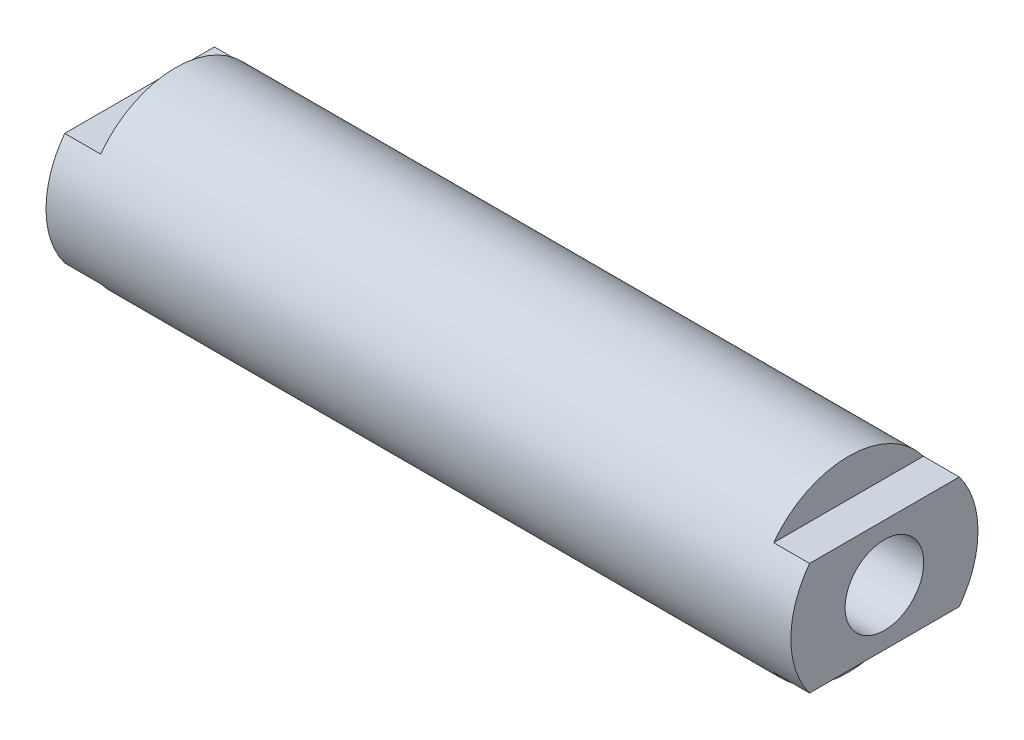
ISO-10303-21;
HEADER;
FILE_DESCRIPTION(('STEP AP214'),'2;1');
FILE_NAME('part.step','',(''),(''),'','','');
FILE_SCHEMA(('AUTOMOTIVE_DESIGN { 1 0 10303 214 1 1 1 1 }'));
ENDSEC;
DATA;
#1=APPLICATION_CONTEXT('core data for automotive mechanical design processes');
#2=APPLICATION_PROTOCOL_DEFINITION('international standard','automotive_design',2000,#1);
#3=PRODUCT_CONTEXT('',#1,'mechanical');
#4=PRODUCT('Part','Part','',(#3));
#5=PRODUCT_RELATED_PRODUCT_CATEGORY('part','',(#4));
#6=PRODUCT_DEFINITION_FORMATION('','',#4);
#7=PRODUCT_DEFINITION_CONTEXT('part definition',#1,'design');
#8=PRODUCT_DEFINITION('design','',#6,#7);
#9=PRODUCT_DEFINITION_SHAPE('','',#8);
#10=(LENGTH_UNIT() NAMED_UNIT(*) SI_UNIT(.MILLI.,.METRE.));
#11=(NAMED_UNIT(*) PLANE_ANGLE_UNIT() SI_UNIT($,.RADIAN.));
#12=(NAMED_UNIT(*) SI_UNIT($,.STERADIAN.) SOLID_ANGLE_UNIT());
#13=UNCERTAINTY_MEASURE_WITH_UNIT(LENGTH_MEASURE(1.E-05),#10,'distance_accuracy_value','');
#14=(GEOMETRIC_REPRESENTATION_CONTEXT(3) GLOBAL_UNCERTAINTY_ASSIGNED_CONTEXT((#13)) GLOBAL_UNIT_ASSIGNED_CONTEXT((#10,
#11,#12)) REPRESENTATION_CONTEXT('',''));
#15=CARTESIAN_POINT('',(0.,0.,0.));
#16=DIRECTION('',(0.,0.,1.));
#17=DIRECTION('',(1.,0.,0.));
#18=AXIS2_PLACEMENT_3D('',#15,#16,#17);
#19=CARTESIAN_POINT('',(-69.457729468599,0.,0.));
#20=DIRECTION('',(-1.,0.,0.));
#21=DIRECTION('',(0.,0.,1.));
#22=AXIS2_PLACEMENT_3D('',#19,#20,#21);
#23=CYLINDRICAL_SURFACE('',#22,12.5);
#24=DIRECTION('',(-1.,0.,0.));
#25=VECTOR('',#24,1.);
#26=CARTESIAN_POINT('',(-69.457729468599,-7.5,-10.));
#27=LINE('',#26,#25);
#28=CARTESIAN_POINT('',(-49.75,-7.5,-10.));
#29=VERTEX_POINT('',#28);
#30=CARTESIAN_POINT('',(-44.95,-7.5,-10.));
#31=VERTEX_POINT('',#30);
#32=EDGE_CURVE('E143',#29,#31,#27,.F.);
#33=ORIENTED_EDGE('',*,*,#32,.F.);
#34=CARTESIAN_POINT('',(-49.75,0.,0.));
#35=DIRECTION('',(-1.,0.,0.));
#36=DIRECTION('',(0.,0.,1.));
#37=AXIS2_PLACEMENT_3D('',#34,#35,#36);
#38=CIRCLE('',#37,12.5);
#39=CARTESIAN_POINT('',(-49.75,7.5,-10.));
#40=VERTEX_POINT('',#39);
#41=EDGE_CURVE('E128',#40,#29,#38,.T.);
#42=ORIENTED_EDGE('',*,*,#41,.F.);
#43=DIRECTION('',(-1.,0.,0.));
#44=VECTOR('',#43,1.);
#45=CARTESIAN_POINT('',(-69.457729468599,7.5,-10.));
#46=LINE('',#45,#44);
#47=CARTESIAN_POINT('',(-44.95,7.5,-10.));
#48=VERTEX_POINT('',#47);
#49=EDGE_CURVE('E131',#40,#48,#46,.F.);
#50=ORIENTED_EDGE('',*,*,#49,.T.);
#51=CARTESIAN_POINT('',(-44.95,0.,0.));
#52=DIRECTION('',(1.,0.,0.));
#53=DIRECTION('',(0.,0.,-1.));
#54=AXIS2_PLACEMENT_3D('',#51,#52,#53);
#55=CIRCLE('',#54,12.5);
#56=CARTESIAN_POINT('',(-44.95,7.5,10.));
#57=VERTEX_POINT('',#56);
#58=EDGE_CURVE('E134',#48,#57,#55,.T.);
#59=ORIENTED_EDGE('',*,*,#58,.T.);
#60=DIRECTION('',(-1.,0.,0.));
#61=VECTOR('',#60,1.);
#62=CARTESIAN_POINT('',(-69.457729468599,7.5,10.));
#63=LINE('',#62,#61);
#64=CARTESIAN_POINT('',(-49.75,7.5,10.));
#65=VERTEX_POINT('',#64);
#66=EDGE_CURVE('E136',#57,#65,#63,.T.);
#67=ORIENTED_EDGE('',*,*,#66,.T.);
#68=CARTESIAN_POINT('',(-49.75,-7.5,10.));
#69=VERTEX_POINT('',#68);
#70=EDGE_CURVE('E122',#69,#65,#38,.T.);
#71=ORIENTED_EDGE('',*,*,#70,.F.);
#72=DIRECTION('',(-1.,0.,0.));
#73=VECTOR('',#72,1.);
#74=CARTESIAN_POINT('',(-69.457729468599,-7.5,10.));
#75=LINE('',#74,#73);
#76=CARTESIAN_POINT('',(-44.95,-7.5,10.));
#77=VERTEX_POINT('',#76);
#78=EDGE_CURVE('E141',#77,#69,#75,.T.);
#79=ORIENTED_EDGE('',*,*,#78,.F.);
#80=CARTESIAN_POINT('',(-44.95,0.,0.));
#81=DIRECTION('',(-1.,0.,0.));
#82=DIRECTION('',(0.,0.,1.));
#83=AXIS2_PLACEMENT_3D('',#80,#81,#82);
#84=CIRCLE('',#83,12.5);
#85=EDGE_CURVE('E139',#31,#77,#84,.T.);
#86=ORIENTED_EDGE('',*,*,#85,.F.);
#87=EDGE_LOOP('',(#33,#42,#50,#59,#67,#71,#79,#86));
#88=FACE_BOUND('',#87,.T.);
#89=DIRECTION('',(-1.,0.,0.));
#90=VECTOR('',#89,1.);
#91=CARTESIAN_POINT('',(-69.457729468599,7.5,-10.));
#92=LINE('',#91,#90);
#93=CARTESIAN_POINT('',(49.75,7.5,-10.));
#94=VERTEX_POINT('',#93);
#95=CARTESIAN_POINT('',(44.95,7.5,-10.));
#96=VERTEX_POINT('',#95);
#97=EDGE_CURVE('E108',#94,#96,#92,.T.);
#98=ORIENTED_EDGE('',*,*,#97,.F.);
#99=CARTESIAN_POINT('',(49.75,0.,0.));
#100=DIRECTION('',(-1.,0.,0.));
#101=DIRECTION('',(0.,0.,1.));
#102=AXIS2_PLACEMENT_3D('',#99,#100,#101);
#103=CIRCLE('',#102,12.5);
#104=CARTESIAN_POINT('',(49.75,-7.5,-10.));
#105=VERTEX_POINT('',#104);
#106=EDGE_CURVE('E59',#94,#105,#103,.T.);
#107=ORIENTED_EDGE('',*,*,#106,.T.);
#108=DIRECTION('',(-1.,0.,0.));
#109=VECTOR('',#108,1.);
#110=CARTESIAN_POINT('',(-69.457729468599,-7.5,-10.));
#111=LINE('',#110,#109);
#112=CARTESIAN_POINT('',(44.95,-7.5,-10.));
#113=VERTEX_POINT('',#112);
#114=EDGE_CURVE('E150',#105,#113,#111,.T.);
#115=ORIENTED_EDGE('',*,*,#114,.T.);
#116=CARTESIAN_POINT('',(44.95,0.,0.));
#117=DIRECTION('',(-1.,0.,0.));
#118=DIRECTION('',(0.,0.,1.));
#119=AXIS2_PLACEMENT_3D('',#116,#117,#118);
#120=CIRCLE('',#119,12.5);
#121=CARTESIAN_POINT('',(44.95,-7.5,10.));
#122=VERTEX_POINT('',#121);
#123=EDGE_CURVE('E113',#113,#122,#120,.T.);
#124=ORIENTED_EDGE('',*,*,#123,.T.);
#125=DIRECTION('',(-1.,0.,0.));
#126=VECTOR('',#125,1.);
#127=CARTESIAN_POINT('',(-69.457729468599,-7.5,10.));
#128=LINE('',#127,#126);
#129=CARTESIAN_POINT('',(49.75,-7.5,10.));
#130=VERTEX_POINT('',#129);
#131=EDGE_CURVE('E149',#122,#130,#128,.F.);
#132=ORIENTED_EDGE('',*,*,#131,.T.);
#133=CARTESIAN_POINT('',(49.75,7.5,10.));
#134=VERTEX_POINT('',#133);
#135=EDGE_CURVE('E119',#130,#134,#103,.T.);
#136=ORIENTED_EDGE('',*,*,#135,.T.);
#137=DIRECTION('',(-1.,0.,0.));
#138=VECTOR('',#137,1.);
#139=CARTESIAN_POINT('',(-69.457729468599,7.5,10.));
#140=LINE('',#139,#138);
#141=CARTESIAN_POINT('',(44.95,7.5,10.));
#142=VERTEX_POINT('',#141);
#143=EDGE_CURVE('E51',#142,#134,#140,.F.);
#144=ORIENTED_EDGE('',*,*,#143,.F.);
#145=CARTESIAN_POINT('',(44.95,0.,0.));
#146=DIRECTION('',(1.,0.,0.));
#147=DIRECTION('',(0.,0.,-1.));
#148=AXIS2_PLACEMENT_3D('',#145,#146,#147);
#149=CIRCLE('',#148,12.5);
#150=EDGE_CURVE('E11',#96,#142,#149,.T.);
#151=ORIENTED_EDGE('',*,*,#150,.F.);
#152=EDGE_LOOP('',(#98,#107,#115,#124,#132,#136,#144,#151));
#153=FACE_BOUND('',#152,.T.);
#154=ADVANCED_FACE('F36',(#88,#153),#23,.T.);
#155=CARTESIAN_POINT('',(49.75,0.,0.));
#156=DIRECTION('',(-1.,0.,0.));
#157=DIRECTION('',(0.,0.,1.));
#158=AXIS2_PLACEMENT_3D('',#155,#156,#157);
#159=PLANE('',#158);
#160=CARTESIAN_POINT('',(49.75,0.,0.));
#161=DIRECTION('',(1.,0.,0.));
#162=DIRECTION('',(0.,0.,-1.));
#163=AXIS2_PLACEMENT_3D('',#160,#161,#162);
#164=CIRCLE('',#163,5.25);
#165=CARTESIAN_POINT('',(49.75,0.,-5.25));
#166=VERTEX_POINT('',#165);
#167=EDGE_CURVE('E114',#166,#166,#164,.T.);
#168=ORIENTED_EDGE('',*,*,#167,.F.);
#169=EDGE_LOOP('',(#168));
#170=FACE_BOUND('',#169,.T.);
#171=DIRECTION('',(0.,0.,-1.));
#172=VECTOR('',#171,1.);
#173=CARTESIAN_POINT('',(49.75,7.5,0.));
#174=LINE('',#173,#172);
#175=EDGE_CURVE('E44',#134,#94,#174,.T.);
#176=ORIENTED_EDGE('',*,*,#175,.F.);
#177=ORIENTED_EDGE('',*,*,#135,.F.);
#178=DIRECTION('',(0.,0.,-1.));
#179=VECTOR('',#178,1.);
#180=CARTESIAN_POINT('',(49.75,-7.5,0.));
#181=LINE('',#180,#179);
#182=EDGE_CURVE('E118',#130,#105,#181,.T.);
#183=ORIENTED_EDGE('',*,*,#182,.T.);
#184=ORIENTED_EDGE('',*,*,#106,.F.);
#185=EDGE_LOOP('',(#176,#177,#183,#184));
#186=FACE_BOUND('',#185,.T.);
#187=ADVANCED_FACE('F117',(#170,#186),#159,.F.);
#188=CARTESIAN_POINT('',(-49.75,0.,0.));
#189=DIRECTION('',(1.,0.,0.));
#190=DIRECTION('',(0.,0.,-1.));
#191=AXIS2_PLACEMENT_3D('',#188,#189,#190);
#192=PLANE('',#191);
#193=CARTESIAN_POINT('',(-49.75,0.,0.));
#194=DIRECTION('',(-1.,0.,0.));
#195=DIRECTION('',(0.,0.,1.));
#196=AXIS2_PLACEMENT_3D('',#193,#194,#195);
#197=CIRCLE('',#196,5.25);
#198=CARTESIAN_POINT('',(-49.75,0.,5.25));
#199=VERTEX_POINT('',#198);
#200=EDGE_CURVE('E166',#199,#199,#197,.T.);
#201=ORIENTED_EDGE('',*,*,#200,.F.);
#202=EDGE_LOOP('',(#201));
#203=FACE_BOUND('',#202,.T.);
#204=DIRECTION('',(0.,0.,1.));
#205=VECTOR('',#204,1.);
#206=CARTESIAN_POINT('',(-49.75,-7.5,-12.5));
#207=LINE('',#206,#205);
#208=EDGE_CURVE('E173',#29,#69,#207,.T.);
#209=ORIENTED_EDGE('',*,*,#208,.T.);
#210=ORIENTED_EDGE('',*,*,#70,.T.);
#211=DIRECTION('',(0.,0.,1.));
#212=VECTOR('',#211,1.);
#213=CARTESIAN_POINT('',(-49.75,7.5,-12.5));
#214=LINE('',#213,#212);
#215=EDGE_CURVE('E124',#40,#65,#214,.T.);
#216=ORIENTED_EDGE('',*,*,#215,.F.);
#217=ORIENTED_EDGE('',*,*,#41,.T.);
#218=EDGE_LOOP('',(#209,#210,#216,#217));
#219=FACE_BOUND('',#218,.T.);
#220=ADVANCED_FACE('F38',(#203,#219),#192,.F.);
#221=CARTESIAN_POINT('',(-44.95,12.5,-12.5));
#222=DIRECTION('',(1.,0.,0.));
#223=DIRECTION('',(0.,0.,-1.));
#224=AXIS2_PLACEMENT_3D('',#221,#222,#223);
#225=PLANE('',#224);
#226=DIRECTION('',(0.,0.,1.));
#227=VECTOR('',#226,1.);
#228=CARTESIAN_POINT('',(-44.95,7.5,-12.5));
#229=LINE('',#228,#227);
#230=EDGE_CURVE('E120',#48,#57,#229,.T.);
#231=ORIENTED_EDGE('',*,*,#230,.T.);
#232=ORIENTED_EDGE('',*,*,#58,.F.);
#233=EDGE_LOOP('',(#231,#232));
#234=FACE_BOUND('',#233,.T.);
#235=ADVANCED_FACE('F194',(#234),#225,.F.);
#236=CARTESIAN_POINT('',(-49.75,7.5,-12.5));
#237=DIRECTION('',(0.,-1.,0.));
#238=DIRECTION('',(0.,0.,-1.));
#239=AXIS2_PLACEMENT_3D('',#236,#237,#238);
#240=PLANE('',#239);
#241=ORIENTED_EDGE('',*,*,#230,.F.);
#242=ORIENTED_EDGE('',*,*,#49,.F.);
#243=ORIENTED_EDGE('',*,*,#215,.T.);
#244=ORIENTED_EDGE('',*,*,#66,.F.);
#245=EDGE_LOOP('',(#241,#242,#243,#244));
#246=FACE_BOUND('',#245,.T.);
#247=ADVANCED_FACE('F191',(#246),#240,.F.);
#248=CARTESIAN_POINT('',(-49.75,-7.5,-12.5));
#249=DIRECTION('',(0.,-1.,0.));
#250=DIRECTION('',(0.,0.,-1.));
#251=AXIS2_PLACEMENT_3D('',#248,#249,#250);
#252=PLANE('',#251);
#253=ORIENTED_EDGE('',*,*,#78,.T.);
#254=ORIENTED_EDGE('',*,*,#208,.F.);
#255=ORIENTED_EDGE('',*,*,#32,.T.);
#256=DIRECTION('',(0.,0.,1.));
#257=VECTOR('',#256,1.);
#258=CARTESIAN_POINT('',(-44.95,-7.5,-12.5));
#259=LINE('',#258,#257);
#260=EDGE_CURVE('E172',#31,#77,#259,.T.);
#261=ORIENTED_EDGE('',*,*,#260,.T.);
#262=EDGE_LOOP('',(#253,#254,#255,#261));
#263=FACE_BOUND('',#262,.T.);
#264=ADVANCED_FACE('F180',(#263),#252,.T.);
#265=CARTESIAN_POINT('',(-44.95,-12.5,-12.5));
#266=DIRECTION('',(-1.,0.,0.));
#267=DIRECTION('',(0.,0.,1.));
#268=AXIS2_PLACEMENT_3D('',#265,#266,#267);
#269=PLANE('',#268);
#270=ORIENTED_EDGE('',*,*,#260,.F.);
#271=ORIENTED_EDGE('',*,*,#85,.T.);
#272=EDGE_LOOP('',(#270,#271));
#273=FACE_BOUND('',#272,.T.);
#274=ADVANCED_FACE('F246',(#273),#269,.T.);
#275=CARTESIAN_POINT('',(-16.75,0.,0.));
#276=DIRECTION('',(-1.,0.,0.));
#277=DIRECTION('',(0.,0.,1.));
#278=AXIS2_PLACEMENT_3D('',#275,#276,#277);
#279=CONICAL_SURFACE('',#278,5.24999999999999,1.02974425867665);
#280=CARTESIAN_POINT('',(-13.5954817501053,0.,0.));
#281=VERTEX_POINT('',#280);
#282=VERTEX_LOOP('',#281);
#283=FACE_BOUND('',#282,.T.);
#284=CARTESIAN_POINT('',(-16.75,0.,0.));
#285=DIRECTION('',(-1.,0.,0.));
#286=DIRECTION('',(0.,0.,1.));
#287=AXIS2_PLACEMENT_3D('',#284,#285,#286);
#288=CIRCLE('',#287,5.24999999999999);
#289=CARTESIAN_POINT('',(-16.75,0.,5.24999999999999));
#290=VERTEX_POINT('',#289);
#291=EDGE_CURVE('E169',#290,#290,#288,.T.);
#292=ORIENTED_EDGE('',*,*,#291,.T.);
#293=EDGE_LOOP('',(#292));
#294=FACE_BOUND('',#293,.T.);
#295=ADVANCED_FACE('F242',(#283,#294),#279,.F.);
#296=CARTESIAN_POINT('',(-49.75,0.,0.));
#297=DIRECTION('',(-1.,0.,0.));
#298=DIRECTION('',(0.,0.,1.));
#299=AXIS2_PLACEMENT_3D('',#296,#297,#298);
#300=CYLINDRICAL_SURFACE('',#299,5.24999999999999);
#301=ORIENTED_EDGE('',*,*,#291,.F.);
#302=EDGE_LOOP('',(#301));
#303=FACE_BOUND('',#302,.T.);
#304=ORIENTED_EDGE('',*,*,#200,.T.);
#305=EDGE_LOOP('',(#304));
#306=FACE_BOUND('',#305,.T.);
#307=ADVANCED_FACE('F237',(#303,#306),#300,.F.);
#308=CARTESIAN_POINT('',(44.95,-12.5,-12.5));
#309=DIRECTION('',(-1.,0.,0.));
#310=DIRECTION('',(0.,0.,1.));
#311=AXIS2_PLACEMENT_3D('',#308,#309,#310);
#312=PLANE('',#311);
#313=DIRECTION('',(0.,0.,1.));
#314=VECTOR('',#313,1.);
#315=CARTESIAN_POINT('',(44.95,-7.5,-12.5));
#316=LINE('',#315,#314);
#317=EDGE_CURVE('E155',#113,#122,#316,.T.);
#318=ORIENTED_EDGE('',*,*,#317,.T.);
#319=ORIENTED_EDGE('',*,*,#123,.F.);
#320=EDGE_LOOP('',(#318,#319));
#321=FACE_BOUND('',#320,.T.);
#322=ADVANCED_FACE('F154',(#321),#312,.F.);
#323=CARTESIAN_POINT('',(49.75,-7.5,-12.5));
#324=DIRECTION('',(0.,1.,0.));
#325=DIRECTION('',(0.,0.,1.));
#326=AXIS2_PLACEMENT_3D('',#323,#324,#325);
#327=PLANE('',#326);
#328=ORIENTED_EDGE('',*,*,#182,.F.);
#329=ORIENTED_EDGE('',*,*,#131,.F.);
#330=ORIENTED_EDGE('',*,*,#317,.F.);
#331=ORIENTED_EDGE('',*,*,#114,.F.);
#332=EDGE_LOOP('',(#328,#329,#330,#331));
#333=FACE_BOUND('',#332,.T.);
#334=ADVANCED_FACE('F157',(#333),#327,.F.);
#335=CARTESIAN_POINT('',(16.75,0.,0.));
#336=DIRECTION('',(1.,0.,0.));
#337=DIRECTION('',(0.,0.,-1.));
#338=AXIS2_PLACEMENT_3D('',#335,#336,#337);
#339=CONICAL_SURFACE('',#338,5.24999999999999,1.02974425867665);
#340=CARTESIAN_POINT('',(13.5954817501053,0.,0.));
#341=VERTEX_POINT('',#340);
#342=VERTEX_LOOP('',#341);
#343=FACE_BOUND('',#342,.T.);
#344=CARTESIAN_POINT('',(16.75,0.,0.));
#345=DIRECTION('',(1.,0.,0.));
#346=DIRECTION('',(0.,0.,-1.));
#347=AXIS2_PLACEMENT_3D('',#344,#345,#346);
#348=CIRCLE('',#347,5.24999999999999);
#349=CARTESIAN_POINT('',(16.75,0.,-5.24999999999999));
#350=VERTEX_POINT('',#349);
#351=EDGE_CURVE('E158',#350,#350,#348,.T.);
#352=ORIENTED_EDGE('',*,*,#351,.T.);
#353=EDGE_LOOP('',(#352));
#354=FACE_BOUND('',#353,.T.);
#355=ADVANCED_FACE('F228',(#343,#354),#339,.F.);
#356=CARTESIAN_POINT('',(49.75,0.,0.));
#357=DIRECTION('',(1.,0.,0.));
#358=DIRECTION('',(0.,0.,-1.));
#359=AXIS2_PLACEMENT_3D('',#356,#357,#358);
#360=CYLINDRICAL_SURFACE('',#359,5.24999999999999);
#361=ORIENTED_EDGE('',*,*,#351,.F.);
#362=EDGE_LOOP('',(#361));
#363=FACE_BOUND('',#362,.T.);
#364=ORIENTED_EDGE('',*,*,#167,.T.);
#365=EDGE_LOOP('',(#364));
#366=FACE_BOUND('',#365,.T.);
#367=ADVANCED_FACE('F221',(#363,#366),#360,.F.);
#368=CARTESIAN_POINT('',(44.95,12.5,-12.5));
#369=DIRECTION('',(1.,0.,0.));
#370=DIRECTION('',(0.,0.,-1.));
#371=AXIS2_PLACEMENT_3D('',#368,#369,#370);
#372=PLANE('',#371);
#373=DIRECTION('',(0.,0.,1.));
#374=VECTOR('',#373,1.);
#375=CARTESIAN_POINT('',(44.95,7.5,-12.5));
#376=LINE('',#375,#374);
#377=EDGE_CURVE('E217',#96,#142,#376,.T.);
#378=ORIENTED_EDGE('',*,*,#377,.F.);
#379=ORIENTED_EDGE('',*,*,#150,.T.);
#380=EDGE_LOOP('',(#378,#379));
#381=FACE_BOUND('',#380,.T.);
#382=ADVANCED_FACE('F219',(#381),#372,.T.);
#383=CARTESIAN_POINT('',(49.75,7.5,-12.5));
#384=DIRECTION('',(0.,1.,0.));
#385=DIRECTION('',(0.,0.,1.));
#386=AXIS2_PLACEMENT_3D('',#383,#384,#385);
#387=PLANE('',#386);
#388=ORIENTED_EDGE('',*,*,#97,.T.);
#389=ORIENTED_EDGE('',*,*,#377,.T.);
#390=ORIENTED_EDGE('',*,*,#143,.T.);
#391=ORIENTED_EDGE('',*,*,#175,.T.);
#392=EDGE_LOOP('',(#388,#389,#390,#391));
#393=FACE_BOUND('',#392,.T.);
#394=ADVANCED_FACE('F107',(#393),#387,.T.);
#395=CLOSED_SHELL('',(#154,#187,#220,#235,#247,#264,#274,#295,#307,#322,#334,#355,#367,#382,#394));
#396=MANIFOLD_SOLID_BREP('B2',#395);
#397=ADVANCED_BREP_SHAPE_REPRESENTATION('',(#18,#396),#14);
#398=SHAPE_DEFINITION_REPRESENTATION(#9,#397);
ENDSEC;
END-ISO-10303-21;
